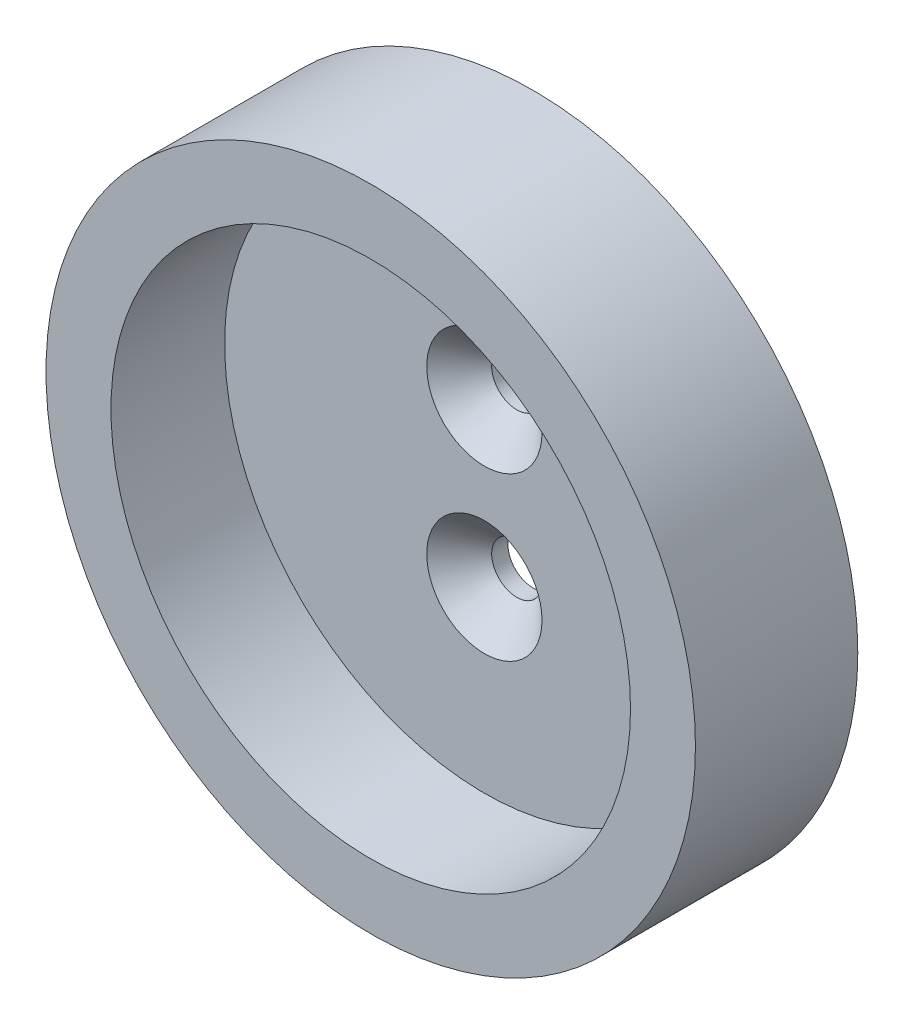
ISO-10303-21;
HEADER;
FILE_DESCRIPTION(('STEP AP214'),'2;1');
FILE_NAME('part.step','',(''),(''),'','','');
FILE_SCHEMA(('AUTOMOTIVE_DESIGN { 1 0 10303 214 1 1 1 1 }'));
ENDSEC;
DATA;
#1=APPLICATION_CONTEXT('core data for automotive mechanical design processes');
#2=APPLICATION_PROTOCOL_DEFINITION('international standard','automotive_design',2000,#1);
#3=PRODUCT_CONTEXT('',#1,'mechanical');
#4=PRODUCT('Part','Part','',(#3));
#5=PRODUCT_RELATED_PRODUCT_CATEGORY('part','',(#4));
#6=PRODUCT_DEFINITION_FORMATION('','',#4);
#7=PRODUCT_DEFINITION_CONTEXT('part definition',#1,'design');
#8=PRODUCT_DEFINITION('design','',#6,#7);
#9=PRODUCT_DEFINITION_SHAPE('','',#8);
#10=(LENGTH_UNIT() NAMED_UNIT(*) SI_UNIT(.MILLI.,.METRE.));
#11=(NAMED_UNIT(*) PLANE_ANGLE_UNIT() SI_UNIT($,.RADIAN.));
#12=(NAMED_UNIT(*) SI_UNIT($,.STERADIAN.) SOLID_ANGLE_UNIT());
#13=UNCERTAINTY_MEASURE_WITH_UNIT(LENGTH_MEASURE(1.E-05),#10,'distance_accuracy_value','');
#14=(GEOMETRIC_REPRESENTATION_CONTEXT(3) GLOBAL_UNCERTAINTY_ASSIGNED_CONTEXT((#13)) GLOBAL_UNIT_ASSIGNED_CONTEXT((#10,
#11,#12)) REPRESENTATION_CONTEXT('',''));
#15=CARTESIAN_POINT('',(0.,0.,0.));
#16=DIRECTION('',(0.,0.,1.));
#17=DIRECTION('',(1.,0.,0.));
#18=AXIS2_PLACEMENT_3D('',#15,#16,#17);
#19=CARTESIAN_POINT('',(0.,0.,10.));
#20=DIRECTION('',(0.,0.,-1.));
#21=DIRECTION('',(-1.,0.,0.));
#22=AXIS2_PLACEMENT_3D('',#19,#20,#21);
#23=CYLINDRICAL_SURFACE('',#22,20.);
#24=CARTESIAN_POINT('',(0.,0.,10.));
#25=DIRECTION('',(0.,0.,1.));
#26=DIRECTION('',(1.,0.,0.));
#27=AXIS2_PLACEMENT_3D('',#24,#25,#26);
#28=CIRCLE('',#27,20.);
#29=CARTESIAN_POINT('',(20.,0.,10.));
#30=VERTEX_POINT('',#29);
#31=EDGE_CURVE('E55',#30,#30,#28,.T.);
#32=ORIENTED_EDGE('',*,*,#31,.F.);
#33=EDGE_LOOP('',(#32));
#34=FACE_BOUND('',#33,.T.);
#35=CARTESIAN_POINT('',(0.,0.,0.));
#36=DIRECTION('',(0.,0.,1.));
#37=DIRECTION('',(1.,0.,0.));
#38=AXIS2_PLACEMENT_3D('',#35,#36,#37);
#39=CIRCLE('',#38,20.);
#40=CARTESIAN_POINT('',(20.,0.,0.));
#41=VERTEX_POINT('',#40);
#42=EDGE_CURVE('E56',#41,#41,#39,.T.);
#43=ORIENTED_EDGE('',*,*,#42,.T.);
#44=EDGE_LOOP('',(#43));
#45=FACE_BOUND('',#44,.T.);
#46=ADVANCED_FACE('F35',(#34,#45),#23,.T.);
#47=CARTESIAN_POINT('',(0.,0.,10.));
#48=DIRECTION('',(0.,0.,1.));
#49=DIRECTION('',(1.,0.,0.));
#50=AXIS2_PLACEMENT_3D('',#47,#48,#49);
#51=PLANE('',#50);
#52=CARTESIAN_POINT('',(0.,0.,10.));
#53=DIRECTION('',(0.,0.,1.));
#54=DIRECTION('',(1.,0.,0.));
#55=AXIS2_PLACEMENT_3D('',#52,#53,#54);
#56=CIRCLE('',#55,16.);
#57=CARTESIAN_POINT('',(16.,0.,10.));
#58=VERTEX_POINT('',#57);
#59=EDGE_CURVE('E62',#58,#58,#56,.T.);
#60=ORIENTED_EDGE('',*,*,#59,.F.);
#61=EDGE_LOOP('',(#60));
#62=FACE_BOUND('',#61,.T.);
#63=ORIENTED_EDGE('',*,*,#31,.T.);
#64=EDGE_LOOP('',(#63));
#65=FACE_BOUND('',#64,.T.);
#66=ADVANCED_FACE('F91',(#62,#65),#51,.T.);
#67=CARTESIAN_POINT('',(0.,0.,0.));
#68=DIRECTION('',(0.,0.,1.));
#69=DIRECTION('',(1.,0.,0.));
#70=AXIS2_PLACEMENT_3D('',#67,#68,#69);
#71=PLANE('',#70);
#72=CARTESIAN_POINT('',(0.,5.,0.));
#73=DIRECTION('',(0.,0.,1.));
#74=DIRECTION('',(-1.,0.,0.));
#75=AXIS2_PLACEMENT_3D('',#72,#73,#74);
#76=CIRCLE('',#75,1.55);
#77=CARTESIAN_POINT('',(-1.55,5.,0.));
#78=VERTEX_POINT('',#77);
#79=EDGE_CURVE('E70',#78,#78,#76,.T.);
#80=ORIENTED_EDGE('',*,*,#79,.T.);
#81=EDGE_LOOP('',(#80));
#82=FACE_BOUND('',#81,.T.);
#83=CARTESIAN_POINT('',(0.,-5.,0.));
#84=DIRECTION('',(0.,0.,1.));
#85=DIRECTION('',(1.,0.,0.));
#86=AXIS2_PLACEMENT_3D('',#83,#84,#85);
#87=CIRCLE('',#86,1.55);
#88=CARTESIAN_POINT('',(1.55,-5.,0.));
#89=VERTEX_POINT('',#88);
#90=EDGE_CURVE('E65',#89,#89,#87,.T.);
#91=ORIENTED_EDGE('',*,*,#90,.T.);
#92=EDGE_LOOP('',(#91));
#93=FACE_BOUND('',#92,.T.);
#94=ORIENTED_EDGE('',*,*,#42,.F.);
#95=EDGE_LOOP('',(#94));
#96=FACE_BOUND('',#95,.T.);
#97=ADVANCED_FACE('F74',(#82,#93,#96),#71,.F.);
#98=CARTESIAN_POINT('',(0.,0.,3.));
#99=DIRECTION('',(0.,0.,1.));
#100=DIRECTION('',(1.,0.,0.));
#101=AXIS2_PLACEMENT_3D('',#98,#99,#100);
#102=CYLINDRICAL_SURFACE('',#101,16.);
#103=CARTESIAN_POINT('',(0.,0.,3.));
#104=DIRECTION('',(0.,0.,1.));
#105=DIRECTION('',(1.,0.,0.));
#106=AXIS2_PLACEMENT_3D('',#103,#104,#105);
#107=CIRCLE('',#106,16.);
#108=CARTESIAN_POINT('',(16.,0.,3.));
#109=VERTEX_POINT('',#108);
#110=EDGE_CURVE('E59',#109,#109,#107,.T.);
#111=ORIENTED_EDGE('',*,*,#110,.F.);
#112=EDGE_LOOP('',(#111));
#113=FACE_BOUND('',#112,.T.);
#114=ORIENTED_EDGE('',*,*,#59,.T.);
#115=EDGE_LOOP('',(#114));
#116=FACE_BOUND('',#115,.T.);
#117=ADVANCED_FACE('F103',(#113,#116),#102,.F.);
#118=CARTESIAN_POINT('',(0.,0.,3.));
#119=DIRECTION('',(0.,0.,1.));
#120=DIRECTION('',(1.,0.,0.));
#121=AXIS2_PLACEMENT_3D('',#118,#119,#120);
#122=PLANE('',#121);
#123=CARTESIAN_POINT('',(0.,-5.,3.));
#124=DIRECTION('',(0.,0.,1.));
#125=DIRECTION('',(1.,0.,0.));
#126=AXIS2_PLACEMENT_3D('',#123,#124,#125);
#127=CIRCLE('',#126,3.55);
#128=CARTESIAN_POINT('',(3.55,-5.,3.));
#129=VERTEX_POINT('',#128);
#130=EDGE_CURVE('E42',#129,#129,#127,.F.);
#131=ORIENTED_EDGE('',*,*,#130,.T.);
#132=EDGE_LOOP('',(#131));
#133=FACE_BOUND('',#132,.T.);
#134=CARTESIAN_POINT('',(0.,5.,3.));
#135=DIRECTION('',(0.,0.,1.));
#136=DIRECTION('',(1.,0.,0.));
#137=AXIS2_PLACEMENT_3D('',#134,#135,#136);
#138=CIRCLE('',#137,3.55);
#139=CARTESIAN_POINT('',(3.55,5.,3.));
#140=VERTEX_POINT('',#139);
#141=EDGE_CURVE('E46',#140,#140,#138,.F.);
#142=ORIENTED_EDGE('',*,*,#141,.T.);
#143=EDGE_LOOP('',(#142));
#144=FACE_BOUND('',#143,.T.);
#145=ORIENTED_EDGE('',*,*,#110,.T.);
#146=EDGE_LOOP('',(#145));
#147=FACE_BOUND('',#146,.T.);
#148=ADVANCED_FACE('F87',(#133,#144,#147),#122,.T.);
#149=CARTESIAN_POINT('',(0.,-5.,0.));
#150=DIRECTION('',(0.,0.,1.));
#151=DIRECTION('',(1.,0.,0.));
#152=AXIS2_PLACEMENT_3D('',#149,#150,#151);
#153=CYLINDRICAL_SURFACE('',#152,1.55);
#154=CARTESIAN_POINT('',(0.,-5.,1.));
#155=DIRECTION('',(0.,0.,1.));
#156=DIRECTION('',(1.,0.,0.));
#157=AXIS2_PLACEMENT_3D('',#154,#155,#156);
#158=CIRCLE('',#157,1.55);
#159=CARTESIAN_POINT('',(1.55,-5.,1.));
#160=VERTEX_POINT('',#159);
#161=EDGE_CURVE('E50',#160,#160,#158,.T.);
#162=ORIENTED_EDGE('',*,*,#161,.T.);
#163=EDGE_LOOP('',(#162));
#164=FACE_BOUND('',#163,.T.);
#165=ORIENTED_EDGE('',*,*,#90,.F.);
#166=EDGE_LOOP('',(#165));
#167=FACE_BOUND('',#166,.T.);
#168=ADVANCED_FACE('F80',(#164,#167),#153,.F.);
#169=CARTESIAN_POINT('',(0.,5.,0.));
#170=DIRECTION('',(0.,0.,1.));
#171=DIRECTION('',(1.,0.,0.));
#172=AXIS2_PLACEMENT_3D('',#169,#170,#171);
#173=CYLINDRICAL_SURFACE('',#172,1.55);
#174=CARTESIAN_POINT('',(0.,5.,1.));
#175=DIRECTION('',(0.,0.,1.));
#176=DIRECTION('',(1.,0.,0.));
#177=AXIS2_PLACEMENT_3D('',#174,#175,#176);
#178=CIRCLE('',#177,1.55);
#179=CARTESIAN_POINT('',(1.55,5.,1.));
#180=VERTEX_POINT('',#179);
#181=EDGE_CURVE('E10',#180,#180,#178,.T.);
#182=ORIENTED_EDGE('',*,*,#181,.T.);
#183=EDGE_LOOP('',(#182));
#184=FACE_BOUND('',#183,.T.);
#185=ORIENTED_EDGE('',*,*,#79,.F.);
#186=EDGE_LOOP('',(#185));
#187=FACE_BOUND('',#186,.T.);
#188=ADVANCED_FACE('F77',(#184,#187),#173,.F.);
#189=CARTESIAN_POINT('',(0.,-5.,1.));
#190=DIRECTION('',(0.,0.,1.));
#191=DIRECTION('',(1.,0.,0.));
#192=AXIS2_PLACEMENT_3D('',#189,#190,#191);
#193=CONICAL_SURFACE('',#192,1.55,0.78539816339745);
#194=ORIENTED_EDGE('',*,*,#130,.F.);
#195=EDGE_LOOP('',(#194));
#196=FACE_BOUND('',#195,.T.);
#197=ORIENTED_EDGE('',*,*,#161,.F.);
#198=EDGE_LOOP('',(#197));
#199=FACE_BOUND('',#198,.T.);
#200=ADVANCED_FACE('F79',(#196,#199),#193,.F.);
#201=CARTESIAN_POINT('',(0.,5.,1.));
#202=DIRECTION('',(0.,0.,1.));
#203=DIRECTION('',(1.,0.,0.));
#204=AXIS2_PLACEMENT_3D('',#201,#202,#203);
#205=CONICAL_SURFACE('',#204,1.55,0.78539816339745);
#206=ORIENTED_EDGE('',*,*,#141,.F.);
#207=EDGE_LOOP('',(#206));
#208=FACE_BOUND('',#207,.T.);
#209=ORIENTED_EDGE('',*,*,#181,.F.);
#210=EDGE_LOOP('',(#209));
#211=FACE_BOUND('',#210,.T.);
#212=ADVANCED_FACE('F37',(#208,#211),#205,.F.);
#213=CLOSED_SHELL('',(#46,#66,#97,#117,#148,#168,#188,#200,#212));
#214=MANIFOLD_SOLID_BREP('B2',#213);
#215=ADVANCED_BREP_SHAPE_REPRESENTATION('',(#18,#214),#14);
#216=SHAPE_DEFINITION_REPRESENTATION(#9,#215);
ENDSEC;
END-ISO-10303-21;
